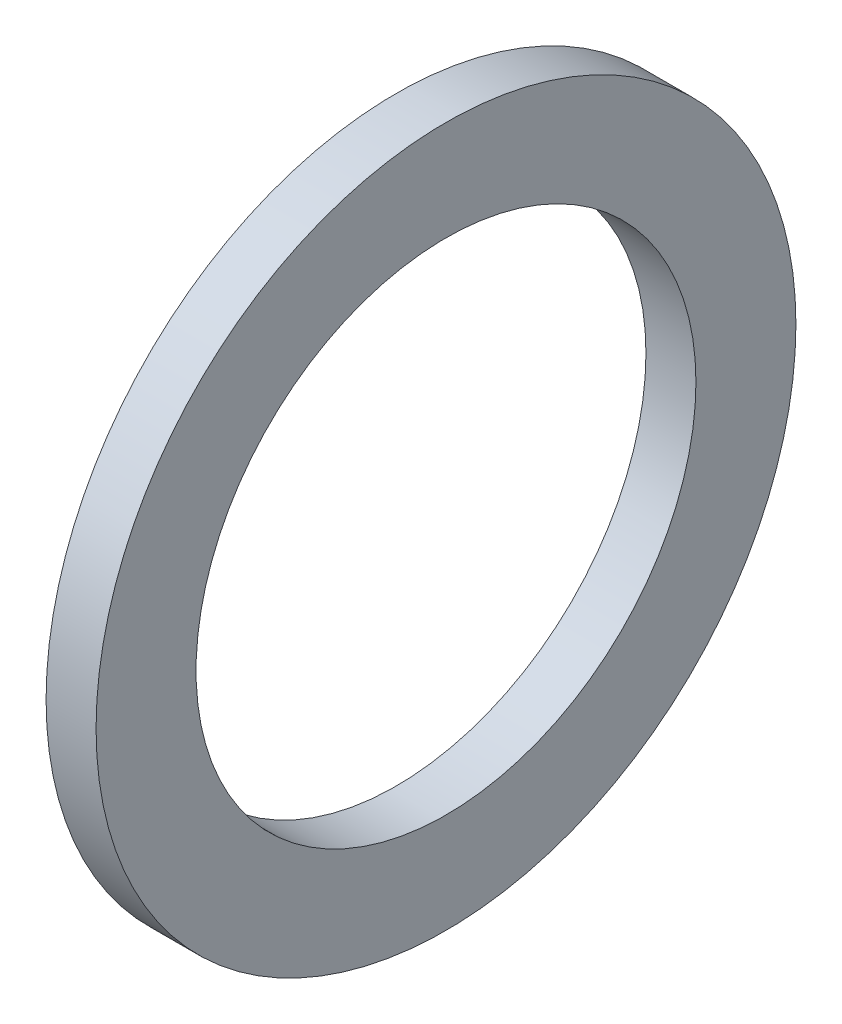
ISO-10303-21;
HEADER;
FILE_DESCRIPTION(('STEP AP214'),'2;1');
FILE_NAME('part.step','',(''),(''),'','','');
FILE_SCHEMA(('AUTOMOTIVE_DESIGN { 1 0 10303 214 1 1 1 1 }'));
ENDSEC;
DATA;
#1=APPLICATION_CONTEXT('core data for automotive mechanical design processes');
#2=APPLICATION_PROTOCOL_DEFINITION('international standard','automotive_design',2000,#1);
#3=PRODUCT_CONTEXT('',#1,'mechanical');
#4=PRODUCT('Part','Part','',(#3));
#5=PRODUCT_RELATED_PRODUCT_CATEGORY('part','',(#4));
#6=PRODUCT_DEFINITION_FORMATION('','',#4);
#7=PRODUCT_DEFINITION_CONTEXT('part definition',#1,'design');
#8=PRODUCT_DEFINITION('design','',#6,#7);
#9=PRODUCT_DEFINITION_SHAPE('','',#8);
#10=(LENGTH_UNIT() NAMED_UNIT(*) SI_UNIT(.MILLI.,.METRE.));
#11=(NAMED_UNIT(*) PLANE_ANGLE_UNIT() SI_UNIT($,.RADIAN.));
#12=(NAMED_UNIT(*) SI_UNIT($,.STERADIAN.) SOLID_ANGLE_UNIT());
#13=UNCERTAINTY_MEASURE_WITH_UNIT(LENGTH_MEASURE(1.E-05),#10,'distance_accuracy_value','');
#14=(GEOMETRIC_REPRESENTATION_CONTEXT(3) GLOBAL_UNCERTAINTY_ASSIGNED_CONTEXT((#13)) GLOBAL_UNIT_ASSIGNED_CONTEXT((#10,
#11,#12)) REPRESENTATION_CONTEXT('',''));
#15=CARTESIAN_POINT('',(0.,0.,0.));
#16=DIRECTION('',(0.,0.,1.));
#17=DIRECTION('',(1.,0.,0.));
#18=AXIS2_PLACEMENT_3D('',#15,#16,#17);
#19=CARTESIAN_POINT('',(0.5,0.,0.));
#20=DIRECTION('',(1.,0.,0.));
#21=DIRECTION('',(0.,0.,-1.));
#22=AXIS2_PLACEMENT_3D('',#19,#20,#21);
#23=PLANE('',#22);
#24=CARTESIAN_POINT('',(0.5,0.,0.));
#25=DIRECTION('',(1.,0.,0.));
#26=DIRECTION('',(0.,0.,-1.));
#27=AXIS2_PLACEMENT_3D('',#24,#25,#26);
#28=CIRCLE('',#27,3.5);
#29=CARTESIAN_POINT('',(0.5,0.,-3.5));
#30=VERTEX_POINT('',#29);
#31=EDGE_CURVE('E10',#30,#30,#28,.T.);
#32=ORIENTED_EDGE('',*,*,#31,.T.);
#33=EDGE_LOOP('',(#32));
#34=FACE_BOUND('',#33,.T.);
#35=CARTESIAN_POINT('',(0.5,0.,0.));
#36=DIRECTION('',(1.,0.,0.));
#37=DIRECTION('',(0.,0.,-1.));
#38=AXIS2_PLACEMENT_3D('',#35,#36,#37);
#39=CIRCLE('',#38,2.5);
#40=CARTESIAN_POINT('',(0.5,0.,-2.5));
#41=VERTEX_POINT('',#40);
#42=EDGE_CURVE('E44',#41,#41,#39,.T.);
#43=ORIENTED_EDGE('',*,*,#42,.F.);
#44=EDGE_LOOP('',(#43));
#45=FACE_BOUND('',#44,.T.);
#46=ADVANCED_FACE('F33',(#34,#45),#23,.T.);
#47=CARTESIAN_POINT('',(0.,0.,0.));
#48=DIRECTION('',(1.,0.,0.));
#49=DIRECTION('',(0.,0.,-1.));
#50=AXIS2_PLACEMENT_3D('',#47,#48,#49);
#51=PLANE('',#50);
#52=CARTESIAN_POINT('',(0.,0.,0.));
#53=DIRECTION('',(1.,0.,0.));
#54=DIRECTION('',(0.,0.,-1.));
#55=AXIS2_PLACEMENT_3D('',#52,#53,#54);
#56=CIRCLE('',#55,3.5);
#57=CARTESIAN_POINT('',(0.,0.,-3.5));
#58=VERTEX_POINT('',#57);
#59=EDGE_CURVE('E37',#58,#58,#56,.T.);
#60=ORIENTED_EDGE('',*,*,#59,.F.);
#61=EDGE_LOOP('',(#60));
#62=FACE_BOUND('',#61,.T.);
#63=CARTESIAN_POINT('',(0.,0.,0.));
#64=DIRECTION('',(1.,0.,0.));
#65=DIRECTION('',(0.,0.,-1.));
#66=AXIS2_PLACEMENT_3D('',#63,#64,#65);
#67=CIRCLE('',#66,2.5);
#68=CARTESIAN_POINT('',(0.,0.,-2.5));
#69=VERTEX_POINT('',#68);
#70=EDGE_CURVE('E46',#69,#69,#67,.T.);
#71=ORIENTED_EDGE('',*,*,#70,.T.);
#72=EDGE_LOOP('',(#71));
#73=FACE_BOUND('',#72,.T.);
#74=ADVANCED_FACE('F56',(#62,#73),#51,.F.);
#75=CARTESIAN_POINT('',(0.5,0.,0.));
#76=DIRECTION('',(-1.,0.,0.));
#77=DIRECTION('',(0.,0.,1.));
#78=AXIS2_PLACEMENT_3D('',#75,#76,#77);
#79=CYLINDRICAL_SURFACE('',#78,3.5);
#80=ORIENTED_EDGE('',*,*,#31,.F.);
#81=EDGE_LOOP('',(#80));
#82=FACE_BOUND('',#81,.T.);
#83=ORIENTED_EDGE('',*,*,#59,.T.);
#84=EDGE_LOOP('',(#83));
#85=FACE_BOUND('',#84,.T.);
#86=ADVANCED_FACE('F35',(#82,#85),#79,.T.);
#87=CARTESIAN_POINT('',(0.5,0.,0.));
#88=DIRECTION('',(-1.,0.,0.));
#89=DIRECTION('',(0.,0.,1.));
#90=AXIS2_PLACEMENT_3D('',#87,#88,#89);
#91=CYLINDRICAL_SURFACE('',#90,2.5);
#92=ORIENTED_EDGE('',*,*,#42,.T.);
#93=EDGE_LOOP('',(#92));
#94=FACE_BOUND('',#93,.T.);
#95=ORIENTED_EDGE('',*,*,#70,.F.);
#96=EDGE_LOOP('',(#95));
#97=FACE_BOUND('',#96,.T.);
#98=ADVANCED_FACE('F52',(#94,#97),#91,.F.);
#99=CLOSED_SHELL('',(#46,#74,#86,#98));
#100=MANIFOLD_SOLID_BREP('B2',#99);
#101=ADVANCED_BREP_SHAPE_REPRESENTATION('',(#18,#100),#14);
#102=SHAPE_DEFINITION_REPRESENTATION(#9,#101);
ENDSEC;
END-ISO-10303-21;
